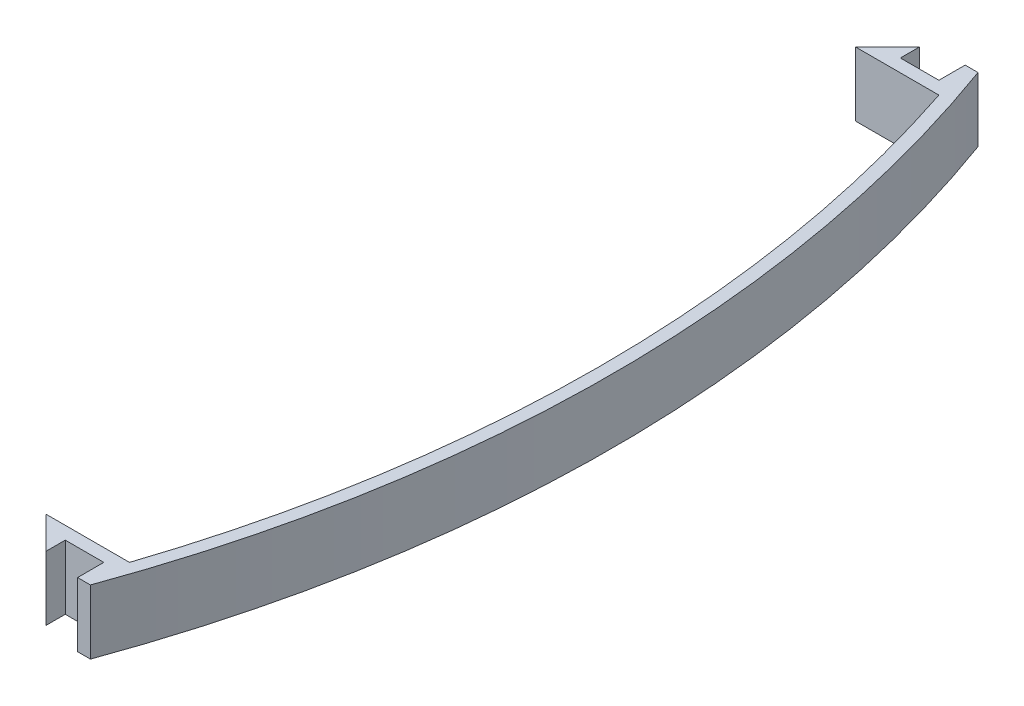
ISO-10303-21;
HEADER;
FILE_DESCRIPTION(('STEP AP214'),'2;1');
FILE_NAME('part.step','',(''),(''),'','','');
FILE_SCHEMA(('AUTOMOTIVE_DESIGN { 1 0 10303 214 1 1 1 1 }'));
ENDSEC;
DATA;
#1=APPLICATION_CONTEXT('core data for automotive mechanical design processes');
#2=APPLICATION_PROTOCOL_DEFINITION('international standard','automotive_design',2000,#1);
#3=PRODUCT_CONTEXT('',#1,'mechanical');
#4=PRODUCT('Part','Part','',(#3));
#5=PRODUCT_RELATED_PRODUCT_CATEGORY('part','',(#4));
#6=PRODUCT_DEFINITION_FORMATION('','',#4);
#7=PRODUCT_DEFINITION_CONTEXT('part definition',#1,'design');
#8=PRODUCT_DEFINITION('design','',#6,#7);
#9=PRODUCT_DEFINITION_SHAPE('','',#8);
#10=(LENGTH_UNIT() NAMED_UNIT(*) SI_UNIT(.MILLI.,.METRE.));
#11=(NAMED_UNIT(*) PLANE_ANGLE_UNIT() SI_UNIT($,.RADIAN.));
#12=(NAMED_UNIT(*) SI_UNIT($,.STERADIAN.) SOLID_ANGLE_UNIT());
#13=UNCERTAINTY_MEASURE_WITH_UNIT(LENGTH_MEASURE(1.E-05),#10,'distance_accuracy_value','');
#14=(GEOMETRIC_REPRESENTATION_CONTEXT(3) GLOBAL_UNCERTAINTY_ASSIGNED_CONTEXT((#13)) GLOBAL_UNIT_ASSIGNED_CONTEXT((#10,
#11,#12)) REPRESENTATION_CONTEXT('',''));
#15=CARTESIAN_POINT('',(0.,0.,0.));
#16=DIRECTION('',(0.,0.,1.));
#17=DIRECTION('',(1.,0.,0.));
#18=AXIS2_PLACEMENT_3D('',#15,#16,#17);
#19=CARTESIAN_POINT('',(-189.818334204049,10.,-1.99999999999998));
#20=DIRECTION('',(0.,-1.,0.));
#21=DIRECTION('',(0.,0.,-1.));
#22=AXIS2_PLACEMENT_3D('',#19,#20,#21);
#23=CYLINDRICAL_SURFACE('',#22,200.);
#24=CARTESIAN_POINT('',(-189.818334204049,0.,-1.99999999999998));
#25=DIRECTION('',(0.,-1.,0.));
#26=DIRECTION('',(0.,0.,-1.));
#27=AXIS2_PLACEMENT_3D('',#24,#25,#26);
#28=CIRCLE('',#27,200.);
#29=CARTESIAN_POINT('',(0.,0.,-65.));
#30=VERTEX_POINT('',#29);
#31=CARTESIAN_POINT('',(0.,0.,61.));
#32=VERTEX_POINT('',#31);
#33=EDGE_CURVE('E165',#30,#32,#28,.T.);
#34=ORIENTED_EDGE('',*,*,#33,.T.);
#35=DIRECTION('',(0.,-1.,0.));
#36=VECTOR('',#35,1.);
#37=CARTESIAN_POINT('',(0.,10.,61.));
#38=LINE('',#37,#36);
#39=CARTESIAN_POINT('',(0.,10.,61.));
#40=VERTEX_POINT('',#39);
#41=EDGE_CURVE('E11',#40,#32,#38,.T.);
#42=ORIENTED_EDGE('',*,*,#41,.F.);
#43=CARTESIAN_POINT('',(-189.818334204049,10.,-1.99999999999998));
#44=DIRECTION('',(0.,-1.,0.));
#45=DIRECTION('',(0.,0.,-1.));
#46=AXIS2_PLACEMENT_3D('',#43,#44,#45);
#47=CIRCLE('',#46,200.);
#48=CARTESIAN_POINT('',(0.,10.,-65.));
#49=VERTEX_POINT('',#48);
#50=EDGE_CURVE('E191',#49,#40,#47,.T.);
#51=ORIENTED_EDGE('',*,*,#50,.F.);
#52=DIRECTION('',(0.,-1.,0.));
#53=VECTOR('',#52,1.);
#54=CARTESIAN_POINT('',(0.,10.,-65.));
#55=LINE('',#54,#53);
#56=EDGE_CURVE('E161',#49,#30,#55,.T.);
#57=ORIENTED_EDGE('',*,*,#56,.T.);
#58=EDGE_LOOP('',(#34,#42,#51,#57));
#59=FACE_BOUND('',#58,.T.);
#60=ADVANCED_FACE('F33',(#59),#23,.F.);
#61=CARTESIAN_POINT('',(0.,10.,61.));
#62=DIRECTION('',(0.,0.,1.));
#63=DIRECTION('',(1.,0.,0.));
#64=AXIS2_PLACEMENT_3D('',#61,#62,#63);
#65=PLANE('',#64);
#66=DIRECTION('',(-1.,0.,0.));
#67=VECTOR('',#66,1.);
#68=CARTESIAN_POINT('',(0.,0.,61.));
#69=LINE('',#68,#67);
#70=CARTESIAN_POINT('',(-13.,0.,61.));
#71=VERTEX_POINT('',#70);
#72=EDGE_CURVE('E168',#32,#71,#69,.T.);
#73=ORIENTED_EDGE('',*,*,#72,.T.);
#74=DIRECTION('',(0.,-1.,0.));
#75=VECTOR('',#74,1.);
#76=CARTESIAN_POINT('',(-13.,10.,61.));
#77=LINE('',#76,#75);
#78=CARTESIAN_POINT('',(-13.,10.,61.));
#79=VERTEX_POINT('',#78);
#80=EDGE_CURVE('E41',#79,#71,#77,.T.);
#81=ORIENTED_EDGE('',*,*,#80,.F.);
#82=DIRECTION('',(-1.,0.,0.));
#83=VECTOR('',#82,1.);
#84=CARTESIAN_POINT('',(0.,10.,61.));
#85=LINE('',#84,#83);
#86=EDGE_CURVE('E110',#40,#79,#85,.T.);
#87=ORIENTED_EDGE('',*,*,#86,.F.);
#88=ORIENTED_EDGE('',*,*,#41,.T.);
#89=EDGE_LOOP('',(#73,#81,#87,#88));
#90=FACE_BOUND('',#89,.T.);
#91=ADVANCED_FACE('F279',(#90),#65,.F.);
#92=CARTESIAN_POINT('',(-13.,10.,61.));
#93=DIRECTION('',(0.707106781186548,0.,-0.707106781186547));
#94=DIRECTION('',(-0.707106781186547,0.,-0.707106781186548));
#95=AXIS2_PLACEMENT_3D('',#92,#93,#94);
#96=PLANE('',#95);
#97=DIRECTION('',(0.707106781186547,0.,0.707106781186548));
#98=VECTOR('',#97,1.);
#99=CARTESIAN_POINT('',(-13.,0.,61.));
#100=LINE('',#99,#98);
#101=CARTESIAN_POINT('',(-7.99999999999998,0.,66.));
#102=VERTEX_POINT('',#101);
#103=EDGE_CURVE('E170',#71,#102,#100,.T.);
#104=ORIENTED_EDGE('',*,*,#103,.T.);
#105=DIRECTION('',(0.,-1.,0.));
#106=VECTOR('',#105,1.);
#107=CARTESIAN_POINT('',(-7.99999999999998,10.,66.));
#108=LINE('',#107,#106);
#109=CARTESIAN_POINT('',(-7.99999999999998,10.,66.));
#110=VERTEX_POINT('',#109);
#111=EDGE_CURVE('E216',#110,#102,#108,.T.);
#112=ORIENTED_EDGE('',*,*,#111,.F.);
#113=DIRECTION('',(0.707106781186547,0.,0.707106781186548));
#114=VECTOR('',#113,1.);
#115=CARTESIAN_POINT('',(-13.,10.,61.));
#116=LINE('',#115,#114);
#117=EDGE_CURVE('E224',#79,#110,#116,.T.);
#118=ORIENTED_EDGE('',*,*,#117,.F.);
#119=ORIENTED_EDGE('',*,*,#80,.T.);
#120=EDGE_LOOP('',(#104,#112,#118,#119));
#121=FACE_BOUND('',#120,.T.);
#122=ADVANCED_FACE('F222',(#121),#96,.F.);
#123=CARTESIAN_POINT('',(-7.99999999999998,10.,66.));
#124=DIRECTION('',(-1.,0.,0.));
#125=DIRECTION('',(0.,0.,1.));
#126=AXIS2_PLACEMENT_3D('',#123,#124,#125);
#127=PLANE('',#126);
#128=DIRECTION('',(0.,0.,-1.));
#129=VECTOR('',#128,1.);
#130=CARTESIAN_POINT('',(-7.99999999999998,0.,66.));
#131=LINE('',#130,#129);
#132=CARTESIAN_POINT('',(-7.99999999999998,0.,63.));
#133=VERTEX_POINT('',#132);
#134=EDGE_CURVE('E172',#102,#133,#131,.T.);
#135=ORIENTED_EDGE('',*,*,#134,.T.);
#136=DIRECTION('',(0.,-1.,0.));
#137=VECTOR('',#136,1.);
#138=CARTESIAN_POINT('',(-7.99999999999998,10.,63.));
#139=LINE('',#138,#137);
#140=CARTESIAN_POINT('',(-7.99999999999998,10.,63.));
#141=VERTEX_POINT('',#140);
#142=EDGE_CURVE('E213',#141,#133,#139,.T.);
#143=ORIENTED_EDGE('',*,*,#142,.F.);
#144=DIRECTION('',(0.,0.,-1.));
#145=VECTOR('',#144,1.);
#146=CARTESIAN_POINT('',(-7.99999999999998,10.,66.));
#147=LINE('',#146,#145);
#148=EDGE_CURVE('E242',#110,#141,#147,.T.);
#149=ORIENTED_EDGE('',*,*,#148,.F.);
#150=ORIENTED_EDGE('',*,*,#111,.T.);
#151=EDGE_LOOP('',(#135,#143,#149,#150));
#152=FACE_BOUND('',#151,.T.);
#153=ADVANCED_FACE('F233',(#152),#127,.F.);
#154=CARTESIAN_POINT('',(-7.99999999999998,10.,63.));
#155=DIRECTION('',(0.,0.,-1.));
#156=DIRECTION('',(-1.,0.,0.));
#157=AXIS2_PLACEMENT_3D('',#154,#155,#156);
#158=PLANE('',#157);
#159=DIRECTION('',(1.,0.,0.));
#160=VECTOR('',#159,1.);
#161=CARTESIAN_POINT('',(-7.99999999999998,0.,63.));
#162=LINE('',#161,#160);
#163=CARTESIAN_POINT('',(-1.99999999999998,0.,63.));
#164=VERTEX_POINT('',#163);
#165=EDGE_CURVE('E174',#133,#164,#162,.T.);
#166=ORIENTED_EDGE('',*,*,#165,.T.);
#167=DIRECTION('',(0.,-1.,0.));
#168=VECTOR('',#167,1.);
#169=CARTESIAN_POINT('',(-1.99999999999998,10.,63.));
#170=LINE('',#169,#168);
#171=CARTESIAN_POINT('',(-1.99999999999998,10.,63.));
#172=VERTEX_POINT('',#171);
#173=EDGE_CURVE('E210',#172,#164,#170,.T.);
#174=ORIENTED_EDGE('',*,*,#173,.F.);
#175=DIRECTION('',(1.,0.,0.));
#176=VECTOR('',#175,1.);
#177=CARTESIAN_POINT('',(-7.99999999999998,10.,63.));
#178=LINE('',#177,#176);
#179=EDGE_CURVE('E239',#141,#172,#178,.T.);
#180=ORIENTED_EDGE('',*,*,#179,.F.);
#181=ORIENTED_EDGE('',*,*,#142,.T.);
#182=EDGE_LOOP('',(#166,#174,#180,#181));
#183=FACE_BOUND('',#182,.T.);
#184=ADVANCED_FACE('F237',(#183),#158,.F.);
#185=CARTESIAN_POINT('',(-1.99999999999998,10.,63.));
#186=DIRECTION('',(1.,0.,0.));
#187=DIRECTION('',(0.,0.,-1.));
#188=AXIS2_PLACEMENT_3D('',#185,#186,#187);
#189=PLANE('',#188);
#190=DIRECTION('',(0.,0.,1.));
#191=VECTOR('',#190,1.);
#192=CARTESIAN_POINT('',(-1.99999999999998,0.,63.));
#193=LINE('',#192,#191);
#194=CARTESIAN_POINT('',(-1.99999999999998,0.,67.0869017976635));
#195=VERTEX_POINT('',#194);
#196=EDGE_CURVE('E176',#164,#195,#193,.T.);
#197=ORIENTED_EDGE('',*,*,#196,.T.);
#198=DIRECTION('',(0.,-1.,0.));
#199=VECTOR('',#198,1.);
#200=CARTESIAN_POINT('',(-1.99999999999998,10.,67.0869017976635));
#201=LINE('',#200,#199);
#202=CARTESIAN_POINT('',(-1.99999999999998,10.,67.0869017976635));
#203=VERTEX_POINT('',#202);
#204=EDGE_CURVE('E207',#203,#195,#201,.T.);
#205=ORIENTED_EDGE('',*,*,#204,.F.);
#206=DIRECTION('',(0.,0.,1.));
#207=VECTOR('',#206,1.);
#208=CARTESIAN_POINT('',(-1.99999999999998,10.,63.));
#209=LINE('',#208,#207);
#210=EDGE_CURVE('E241',#172,#203,#209,.T.);
#211=ORIENTED_EDGE('',*,*,#210,.F.);
#212=ORIENTED_EDGE('',*,*,#173,.T.);
#213=EDGE_LOOP('',(#197,#205,#211,#212));
#214=FACE_BOUND('',#213,.T.);
#215=ADVANCED_FACE('F292',(#214),#189,.F.);
#216=CARTESIAN_POINT('',(0.,10.,67.0869017976635));
#217=DIRECTION('',(0.,0.,-1.));
#218=DIRECTION('',(-1.,0.,0.));
#219=AXIS2_PLACEMENT_3D('',#216,#217,#218);
#220=PLANE('',#219);
#221=DIRECTION('',(1.,0.,0.));
#222=VECTOR('',#221,1.);
#223=CARTESIAN_POINT('',(0.,0.,67.0869017976635));
#224=LINE('',#223,#222);
#225=CARTESIAN_POINT('',(0.,0.,67.0869017976636));
#226=VERTEX_POINT('',#225);
#227=EDGE_CURVE('E178',#195,#226,#224,.T.);
#228=ORIENTED_EDGE('',*,*,#227,.T.);
#229=DIRECTION('',(0.,-1.,0.));
#230=VECTOR('',#229,1.);
#231=CARTESIAN_POINT('',(0.,10.,67.0869017976636));
#232=LINE('',#231,#230);
#233=CARTESIAN_POINT('',(0.,10.,67.0869017976636));
#234=VERTEX_POINT('',#233);
#235=EDGE_CURVE('E204',#234,#226,#232,.T.);
#236=ORIENTED_EDGE('',*,*,#235,.F.);
#237=DIRECTION('',(1.,0.,0.));
#238=VECTOR('',#237,1.);
#239=CARTESIAN_POINT('',(0.,10.,67.0869017976635));
#240=LINE('',#239,#238);
#241=EDGE_CURVE('E244',#203,#234,#240,.T.);
#242=ORIENTED_EDGE('',*,*,#241,.F.);
#243=ORIENTED_EDGE('',*,*,#204,.T.);
#244=EDGE_LOOP('',(#228,#236,#242,#243));
#245=FACE_BOUND('',#244,.T.);
#246=ADVANCED_FACE('F295',(#245),#220,.F.);
#247=CARTESIAN_POINT('',(-189.818334204049,10.,-1.99999999999998));
#248=DIRECTION('',(0.,-1.,0.));
#249=DIRECTION('',(0.,0.,-1.));
#250=AXIS2_PLACEMENT_3D('',#247,#248,#249);
#251=CYLINDRICAL_SURFACE('',#250,202.);
#252=CARTESIAN_POINT('',(-189.818334204049,0.,-1.99999999999998));
#253=DIRECTION('',(0.,1.,0.));
#254=DIRECTION('',(0.,0.,1.));
#255=AXIS2_PLACEMENT_3D('',#252,#253,#254);
#256=CIRCLE('',#255,202.);
#257=CARTESIAN_POINT('',(0.,0.,-71.0869017976635));
#258=VERTEX_POINT('',#257);
#259=EDGE_CURVE('E180',#226,#258,#256,.T.);
#260=ORIENTED_EDGE('',*,*,#259,.T.);
#261=DIRECTION('',(0.,-1.,0.));
#262=VECTOR('',#261,1.);
#263=CARTESIAN_POINT('',(0.,10.,-71.0869017976635));
#264=LINE('',#263,#262);
#265=CARTESIAN_POINT('',(0.,10.,-71.0869017976635));
#266=VERTEX_POINT('',#265);
#267=EDGE_CURVE('E201',#266,#258,#264,.T.);
#268=ORIENTED_EDGE('',*,*,#267,.F.);
#269=CARTESIAN_POINT('',(-189.818334204049,10.,-1.99999999999998));
#270=DIRECTION('',(0.,1.,0.));
#271=DIRECTION('',(0.,0.,1.));
#272=AXIS2_PLACEMENT_3D('',#269,#270,#271);
#273=CIRCLE('',#272,202.);
#274=EDGE_CURVE('E250',#234,#266,#273,.T.);
#275=ORIENTED_EDGE('',*,*,#274,.F.);
#276=ORIENTED_EDGE('',*,*,#235,.T.);
#277=EDGE_LOOP('',(#260,#268,#275,#276));
#278=FACE_BOUND('',#277,.T.);
#279=ADVANCED_FACE('F299',(#278),#251,.T.);
#280=CARTESIAN_POINT('',(0.,10.,-71.0869017976635));
#281=DIRECTION('',(0.,0.,1.));
#282=DIRECTION('',(1.,0.,0.));
#283=AXIS2_PLACEMENT_3D('',#280,#281,#282);
#284=PLANE('',#283);
#285=DIRECTION('',(-1.,0.,0.));
#286=VECTOR('',#285,1.);
#287=CARTESIAN_POINT('',(0.,0.,-71.0869017976635));
#288=LINE('',#287,#286);
#289=CARTESIAN_POINT('',(-2.,0.,-71.0869017976635));
#290=VERTEX_POINT('',#289);
#291=EDGE_CURVE('E182',#258,#290,#288,.T.);
#292=ORIENTED_EDGE('',*,*,#291,.T.);
#293=DIRECTION('',(0.,-1.,0.));
#294=VECTOR('',#293,1.);
#295=CARTESIAN_POINT('',(-2.,10.,-71.0869017976635));
#296=LINE('',#295,#294);
#297=CARTESIAN_POINT('',(-2.,10.,-71.0869017976635));
#298=VERTEX_POINT('',#297);
#299=EDGE_CURVE('E198',#298,#290,#296,.T.);
#300=ORIENTED_EDGE('',*,*,#299,.F.);
#301=DIRECTION('',(-1.,0.,0.));
#302=VECTOR('',#301,1.);
#303=CARTESIAN_POINT('',(0.,10.,-71.0869017976635));
#304=LINE('',#303,#302);
#305=EDGE_CURVE('E252',#266,#298,#304,.T.);
#306=ORIENTED_EDGE('',*,*,#305,.F.);
#307=ORIENTED_EDGE('',*,*,#267,.T.);
#308=EDGE_LOOP('',(#292,#300,#306,#307));
#309=FACE_BOUND('',#308,.T.);
#310=ADVANCED_FACE('F303',(#309),#284,.F.);
#311=CARTESIAN_POINT('',(-2.,10.,-67.));
#312=DIRECTION('',(1.,0.,0.));
#313=DIRECTION('',(0.,0.,-1.));
#314=AXIS2_PLACEMENT_3D('',#311,#312,#313);
#315=PLANE('',#314);
#316=DIRECTION('',(0.,0.,1.));
#317=VECTOR('',#316,1.);
#318=CARTESIAN_POINT('',(-2.,0.,-67.));
#319=LINE('',#318,#317);
#320=CARTESIAN_POINT('',(-2.,0.,-67.));
#321=VERTEX_POINT('',#320);
#322=EDGE_CURVE('E184',#290,#321,#319,.T.);
#323=ORIENTED_EDGE('',*,*,#322,.T.);
#324=DIRECTION('',(0.,-1.,0.));
#325=VECTOR('',#324,1.);
#326=CARTESIAN_POINT('',(-2.,10.,-67.));
#327=LINE('',#326,#325);
#328=CARTESIAN_POINT('',(-2.,10.,-67.));
#329=VERTEX_POINT('',#328);
#330=EDGE_CURVE('E195',#329,#321,#327,.T.);
#331=ORIENTED_EDGE('',*,*,#330,.F.);
#332=DIRECTION('',(0.,0.,1.));
#333=VECTOR('',#332,1.);
#334=CARTESIAN_POINT('',(-2.,10.,-67.));
#335=LINE('',#334,#333);
#336=EDGE_CURVE('E254',#298,#329,#335,.T.);
#337=ORIENTED_EDGE('',*,*,#336,.F.);
#338=ORIENTED_EDGE('',*,*,#299,.T.);
#339=EDGE_LOOP('',(#323,#331,#337,#338));
#340=FACE_BOUND('',#339,.T.);
#341=ADVANCED_FACE('F260',(#340),#315,.F.);
#342=CARTESIAN_POINT('',(-8.,10.,-67.));
#343=DIRECTION('',(0.,0.,1.));
#344=DIRECTION('',(1.,0.,0.));
#345=AXIS2_PLACEMENT_3D('',#342,#343,#344);
#346=PLANE('',#345);
#347=DIRECTION('',(-1.,0.,0.));
#348=VECTOR('',#347,1.);
#349=CARTESIAN_POINT('',(-8.,0.,-67.));
#350=LINE('',#349,#348);
#351=CARTESIAN_POINT('',(-8.,0.,-67.));
#352=VERTEX_POINT('',#351);
#353=EDGE_CURVE('E186',#321,#352,#350,.T.);
#354=ORIENTED_EDGE('',*,*,#353,.T.);
#355=DIRECTION('',(0.,-1.,0.));
#356=VECTOR('',#355,1.);
#357=CARTESIAN_POINT('',(-8.,10.,-67.));
#358=LINE('',#357,#356);
#359=CARTESIAN_POINT('',(-8.,10.,-67.));
#360=VERTEX_POINT('',#359);
#361=EDGE_CURVE('E156',#360,#352,#358,.T.);
#362=ORIENTED_EDGE('',*,*,#361,.F.);
#363=DIRECTION('',(-1.,0.,0.));
#364=VECTOR('',#363,1.);
#365=CARTESIAN_POINT('',(-8.,10.,-67.));
#366=LINE('',#365,#364);
#367=EDGE_CURVE('E147',#329,#360,#366,.T.);
#368=ORIENTED_EDGE('',*,*,#367,.F.);
#369=ORIENTED_EDGE('',*,*,#330,.T.);
#370=EDGE_LOOP('',(#354,#362,#368,#369));
#371=FACE_BOUND('',#370,.T.);
#372=ADVANCED_FACE('F264',(#371),#346,.F.);
#373=CARTESIAN_POINT('',(-8.,10.,-70.));
#374=DIRECTION('',(-1.,0.,0.));
#375=DIRECTION('',(0.,0.,1.));
#376=AXIS2_PLACEMENT_3D('',#373,#374,#375);
#377=PLANE('',#376);
#378=DIRECTION('',(0.,0.,-1.));
#379=VECTOR('',#378,1.);
#380=CARTESIAN_POINT('',(-8.,0.,-70.));
#381=LINE('',#380,#379);
#382=CARTESIAN_POINT('',(-8.,0.,-70.));
#383=VERTEX_POINT('',#382);
#384=EDGE_CURVE('E155',#352,#383,#381,.T.);
#385=ORIENTED_EDGE('',*,*,#384,.T.);
#386=DIRECTION('',(0.,-1.,0.));
#387=VECTOR('',#386,1.);
#388=CARTESIAN_POINT('',(-8.,10.,-70.));
#389=LINE('',#388,#387);
#390=CARTESIAN_POINT('',(-8.,10.,-70.));
#391=VERTEX_POINT('',#390);
#392=EDGE_CURVE('E152',#391,#383,#389,.T.);
#393=ORIENTED_EDGE('',*,*,#392,.F.);
#394=DIRECTION('',(0.,0.,-1.));
#395=VECTOR('',#394,1.);
#396=CARTESIAN_POINT('',(-8.,10.,-70.));
#397=LINE('',#396,#395);
#398=EDGE_CURVE('E141',#360,#391,#397,.T.);
#399=ORIENTED_EDGE('',*,*,#398,.F.);
#400=ORIENTED_EDGE('',*,*,#361,.T.);
#401=EDGE_LOOP('',(#385,#393,#399,#400));
#402=FACE_BOUND('',#401,.T.);
#403=ADVANCED_FACE('F153',(#402),#377,.F.);
#404=CARTESIAN_POINT('',(-13.,10.,-65.));
#405=DIRECTION('',(0.707106781186548,0.,0.707106781186547));
#406=DIRECTION('',(0.707106781186547,0.,-0.707106781186548));
#407=AXIS2_PLACEMENT_3D('',#404,#405,#406);
#408=PLANE('',#407);
#409=DIRECTION('',(-0.707106781186547,0.,0.707106781186548));
#410=VECTOR('',#409,1.);
#411=CARTESIAN_POINT('',(-13.,0.,-65.));
#412=LINE('',#411,#410);
#413=CARTESIAN_POINT('',(-13.,0.,-65.));
#414=VERTEX_POINT('',#413);
#415=EDGE_CURVE('E96',#383,#414,#412,.T.);
#416=ORIENTED_EDGE('',*,*,#415,.T.);
#417=DIRECTION('',(0.,-1.,0.));
#418=VECTOR('',#417,1.);
#419=CARTESIAN_POINT('',(-13.,10.,-65.));
#420=LINE('',#419,#418);
#421=CARTESIAN_POINT('',(-13.,10.,-65.));
#422=VERTEX_POINT('',#421);
#423=EDGE_CURVE('E157',#422,#414,#420,.T.);
#424=ORIENTED_EDGE('',*,*,#423,.F.);
#425=DIRECTION('',(-0.707106781186547,0.,0.707106781186548));
#426=VECTOR('',#425,1.);
#427=CARTESIAN_POINT('',(-13.,10.,-65.));
#428=LINE('',#427,#426);
#429=EDGE_CURVE('E145',#391,#422,#428,.T.);
#430=ORIENTED_EDGE('',*,*,#429,.F.);
#431=ORIENTED_EDGE('',*,*,#392,.T.);
#432=EDGE_LOOP('',(#416,#424,#430,#431));
#433=FACE_BOUND('',#432,.T.);
#434=ADVANCED_FACE('F159',(#433),#408,.F.);
#435=CARTESIAN_POINT('',(0.,10.,-65.));
#436=DIRECTION('',(0.,0.,-1.));
#437=DIRECTION('',(-1.,0.,0.));
#438=AXIS2_PLACEMENT_3D('',#435,#436,#437);
#439=PLANE('',#438);
#440=DIRECTION('',(1.,0.,0.));
#441=VECTOR('',#440,1.);
#442=CARTESIAN_POINT('',(0.,0.,-65.));
#443=LINE('',#442,#441);
#444=EDGE_CURVE('E102',#414,#30,#443,.T.);
#445=ORIENTED_EDGE('',*,*,#444,.T.);
#446=ORIENTED_EDGE('',*,*,#56,.F.);
#447=DIRECTION('',(1.,0.,0.));
#448=VECTOR('',#447,1.);
#449=CARTESIAN_POINT('',(0.,10.,-65.));
#450=LINE('',#449,#448);
#451=EDGE_CURVE('E49',#422,#49,#450,.T.);
#452=ORIENTED_EDGE('',*,*,#451,.F.);
#453=ORIENTED_EDGE('',*,*,#423,.T.);
#454=EDGE_LOOP('',(#445,#446,#452,#453));
#455=FACE_BOUND('',#454,.T.);
#456=ADVANCED_FACE('F268',(#455),#439,.F.);
#457=CARTESIAN_POINT('',(-189.818334204049,10.,-1.99999999999998));
#458=DIRECTION('',(0.,-1.,0.));
#459=DIRECTION('',(0.,0.,-1.));
#460=AXIS2_PLACEMENT_3D('',#457,#458,#459);
#461=PLANE('',#460);
#462=ORIENTED_EDGE('',*,*,#50,.T.);
#463=ORIENTED_EDGE('',*,*,#86,.T.);
#464=ORIENTED_EDGE('',*,*,#117,.T.);
#465=ORIENTED_EDGE('',*,*,#148,.T.);
#466=ORIENTED_EDGE('',*,*,#179,.T.);
#467=ORIENTED_EDGE('',*,*,#210,.T.);
#468=ORIENTED_EDGE('',*,*,#241,.T.);
#469=ORIENTED_EDGE('',*,*,#274,.T.);
#470=ORIENTED_EDGE('',*,*,#305,.T.);
#471=ORIENTED_EDGE('',*,*,#336,.T.);
#472=ORIENTED_EDGE('',*,*,#367,.T.);
#473=ORIENTED_EDGE('',*,*,#398,.T.);
#474=ORIENTED_EDGE('',*,*,#429,.T.);
#475=ORIENTED_EDGE('',*,*,#451,.T.);
#476=EDGE_LOOP('',(#462,#463,#464,#465,#466,#467,#468,#469,#470,#471,#472,#473,#474,#475));
#477=FACE_BOUND('',#476,.T.);
#478=ADVANCED_FACE('F143',(#477),#461,.F.);
#479=CARTESIAN_POINT('',(-189.818334204049,0.,-1.99999999999998));
#480=DIRECTION('',(0.,-1.,0.));
#481=DIRECTION('',(0.,0.,-1.));
#482=AXIS2_PLACEMENT_3D('',#479,#480,#481);
#483=PLANE('',#482);
#484=ORIENTED_EDGE('',*,*,#33,.F.);
#485=ORIENTED_EDGE('',*,*,#444,.F.);
#486=ORIENTED_EDGE('',*,*,#415,.F.);
#487=ORIENTED_EDGE('',*,*,#384,.F.);
#488=ORIENTED_EDGE('',*,*,#353,.F.);
#489=ORIENTED_EDGE('',*,*,#322,.F.);
#490=ORIENTED_EDGE('',*,*,#291,.F.);
#491=ORIENTED_EDGE('',*,*,#259,.F.);
#492=ORIENTED_EDGE('',*,*,#227,.F.);
#493=ORIENTED_EDGE('',*,*,#196,.F.);
#494=ORIENTED_EDGE('',*,*,#165,.F.);
#495=ORIENTED_EDGE('',*,*,#134,.F.);
#496=ORIENTED_EDGE('',*,*,#103,.F.);
#497=ORIENTED_EDGE('',*,*,#72,.F.);
#498=EDGE_LOOP('',(#484,#485,#486,#487,#488,#489,#490,#491,#492,#493,#494,#495,#496,#497));
#499=FACE_BOUND('',#498,.T.);
#500=ADVANCED_FACE('F228',(#499),#483,.T.);
#501=CLOSED_SHELL('',(#60,#91,#122,#153,#184,#215,#246,#279,#310,#341,#372,#403,#434,#456,#478,#500));
#502=MANIFOLD_SOLID_BREP('B2',#501);
#503=ADVANCED_BREP_SHAPE_REPRESENTATION('',(#18,#502),#14);
#504=SHAPE_DEFINITION_REPRESENTATION(#9,#503);
ENDSEC;
END-ISO-10303-21;
